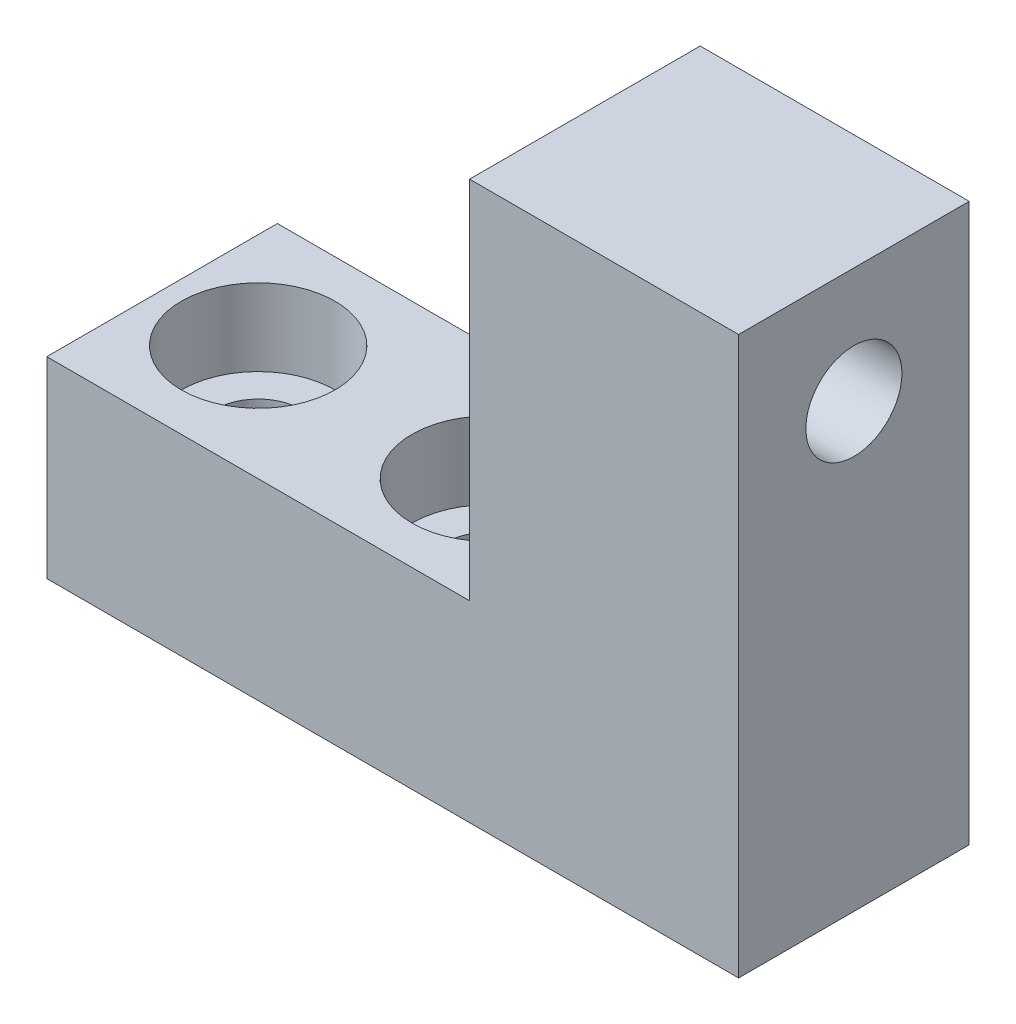
ISO-10303-21;
HEADER;
FILE_DESCRIPTION(('STEP AP214'),'2;1');
FILE_NAME('part.step','',(''),(''),'','','');
FILE_SCHEMA(('AUTOMOTIVE_DESIGN { 1 0 10303 214 1 1 1 1 }'));
ENDSEC;
DATA;
#1=APPLICATION_CONTEXT('core data for automotive mechanical design processes');
#2=APPLICATION_PROTOCOL_DEFINITION('international standard','automotive_design',2000,#1);
#3=PRODUCT_CONTEXT('',#1,'mechanical');
#4=PRODUCT('Part','Part','',(#3));
#5=PRODUCT_RELATED_PRODUCT_CATEGORY('part','',(#4));
#6=PRODUCT_DEFINITION_FORMATION('','',#4);
#7=PRODUCT_DEFINITION_CONTEXT('part definition',#1,'design');
#8=PRODUCT_DEFINITION('design','',#6,#7);
#9=PRODUCT_DEFINITION_SHAPE('','',#8);
#10=(LENGTH_UNIT() NAMED_UNIT(*) SI_UNIT(.MILLI.,.METRE.));
#11=(NAMED_UNIT(*) PLANE_ANGLE_UNIT() SI_UNIT($,.RADIAN.));
#12=(NAMED_UNIT(*) SI_UNIT($,.STERADIAN.) SOLID_ANGLE_UNIT());
#13=UNCERTAINTY_MEASURE_WITH_UNIT(LENGTH_MEASURE(1.E-05),#10,'distance_accuracy_value','');
#14=(GEOMETRIC_REPRESENTATION_CONTEXT(3) GLOBAL_UNCERTAINTY_ASSIGNED_CONTEXT((#13)) GLOBAL_UNIT_ASSIGNED_CONTEXT((#10,
#11,#12)) REPRESENTATION_CONTEXT('',''));
#15=CARTESIAN_POINT('',(0.,0.,0.));
#16=DIRECTION('',(0.,0.,1.));
#17=DIRECTION('',(1.,0.,0.));
#18=AXIS2_PLACEMENT_3D('',#15,#16,#17);
#19=CARTESIAN_POINT('',(8.72260504321214,-6.95626822157435,6.));
#20=DIRECTION('',(0.,1.,0.));
#21=DIRECTION('',(0.,0.,1.));
#22=AXIS2_PLACEMENT_3D('',#19,#20,#21);
#23=CYLINDRICAL_SURFACE('',#22,2.25);
#24=CARTESIAN_POINT('',(8.72260504321214,-6.95626822157435,6.));
#25=DIRECTION('',(0.,1.,0.));
#26=DIRECTION('',(0.,0.,1.));
#27=AXIS2_PLACEMENT_3D('',#24,#25,#26);
#28=CIRCLE('',#27,2.25);
#29=CARTESIAN_POINT('',(8.72260504321214,-6.95626822157435,8.25));
#30=VERTEX_POINT('',#29);
#31=EDGE_CURVE('E146',#30,#30,#28,.T.);
#32=ORIENTED_EDGE('',*,*,#31,.F.);
#33=EDGE_LOOP('',(#32));
#34=FACE_BOUND('',#33,.T.);
#35=CARTESIAN_POINT('',(8.72260504321214,-0.956268221574349,6.));
#36=DIRECTION('',(0.,1.,0.));
#37=DIRECTION('',(0.,0.,1.));
#38=AXIS2_PLACEMENT_3D('',#35,#36,#37);
#39=CIRCLE('',#38,2.25);
#40=CARTESIAN_POINT('',(8.72260504321214,-0.956268221574349,8.25));
#41=VERTEX_POINT('',#40);
#42=EDGE_CURVE('E39',#41,#41,#39,.F.);
#43=ORIENTED_EDGE('',*,*,#42,.F.);
#44=EDGE_LOOP('',(#43));
#45=FACE_BOUND('',#44,.T.);
#46=ADVANCED_FACE('F35',(#34,#45),#23,.F.);
#47=CARTESIAN_POINT('',(-3.27739495678786,-6.95626822157435,6.));
#48=DIRECTION('',(0.,1.,0.));
#49=DIRECTION('',(0.,0.,1.));
#50=AXIS2_PLACEMENT_3D('',#47,#48,#49);
#51=CYLINDRICAL_SURFACE('',#50,2.25);
#52=CARTESIAN_POINT('',(-3.27739495678786,-6.95626822157435,6.));
#53=DIRECTION('',(0.,1.,0.));
#54=DIRECTION('',(0.,0.,1.));
#55=AXIS2_PLACEMENT_3D('',#52,#53,#54);
#56=CIRCLE('',#55,2.25);
#57=CARTESIAN_POINT('',(-3.27739495678786,-6.95626822157435,8.25));
#58=VERTEX_POINT('',#57);
#59=EDGE_CURVE('E121',#58,#58,#56,.T.);
#60=ORIENTED_EDGE('',*,*,#59,.F.);
#61=EDGE_LOOP('',(#60));
#62=FACE_BOUND('',#61,.T.);
#63=CARTESIAN_POINT('',(-3.27739495678786,-0.956268221574349,6.));
#64=DIRECTION('',(0.,1.,0.));
#65=DIRECTION('',(0.,0.,1.));
#66=AXIS2_PLACEMENT_3D('',#63,#64,#65);
#67=CIRCLE('',#66,2.25);
#68=CARTESIAN_POINT('',(-3.27739495678786,-0.956268221574349,8.25));
#69=VERTEX_POINT('',#68);
#70=EDGE_CURVE('E144',#69,#69,#67,.F.);
#71=ORIENTED_EDGE('',*,*,#70,.F.);
#72=EDGE_LOOP('',(#71));
#73=FACE_BOUND('',#72,.T.);
#74=ADVANCED_FACE('F187',(#62,#73),#51,.F.);
#75=CARTESIAN_POINT('',(-8.27739495678786,3.04373177842565,12.));
#76=DIRECTION('',(0.,-1.,0.));
#77=DIRECTION('',(0.,0.,-1.));
#78=AXIS2_PLACEMENT_3D('',#75,#76,#77);
#79=PLANE('',#78);
#80=CARTESIAN_POINT('',(8.72260504321214,3.04373177842565,6.));
#81=DIRECTION('',(0.,1.,0.));
#82=DIRECTION('',(0.,0.,1.));
#83=AXIS2_PLACEMENT_3D('',#80,#81,#82);
#84=CIRCLE('',#83,4.);
#85=CARTESIAN_POINT('',(8.72260504321214,3.04373177842565,10.));
#86=VERTEX_POINT('',#85);
#87=EDGE_CURVE('E159',#86,#86,#84,.T.);
#88=ORIENTED_EDGE('',*,*,#87,.F.);
#89=EDGE_LOOP('',(#88));
#90=FACE_BOUND('',#89,.T.);
#91=CARTESIAN_POINT('',(-3.27739495678786,3.04373177842565,6.));
#92=DIRECTION('',(0.,1.,0.));
#93=DIRECTION('',(0.,0.,1.));
#94=AXIS2_PLACEMENT_3D('',#91,#92,#93);
#95=CIRCLE('',#94,4.);
#96=CARTESIAN_POINT('',(-3.27739495678786,3.04373177842565,10.));
#97=VERTEX_POINT('',#96);
#98=EDGE_CURVE('E152',#97,#97,#95,.T.);
#99=ORIENTED_EDGE('',*,*,#98,.F.);
#100=EDGE_LOOP('',(#99));
#101=FACE_BOUND('',#100,.T.);
#102=DIRECTION('',(0.,0.,1.));
#103=VECTOR('',#102,1.);
#104=CARTESIAN_POINT('',(13.7226050432121,3.04373177842565,12.));
#105=LINE('',#104,#103);
#106=CARTESIAN_POINT('',(13.7226050432121,3.04373177842565,0.));
#107=VERTEX_POINT('',#106);
#108=CARTESIAN_POINT('',(13.7226050432121,3.04373177842565,12.));
#109=VERTEX_POINT('',#108);
#110=EDGE_CURVE('E52',#107,#109,#105,.T.);
#111=ORIENTED_EDGE('',*,*,#110,.F.);
#112=DIRECTION('',(-1.,0.,0.));
#113=VECTOR('',#112,1.);
#114=CARTESIAN_POINT('',(-8.27739495678786,3.04373177842565,0.));
#115=LINE('',#114,#113);
#116=CARTESIAN_POINT('',(-8.27739495678786,3.04373177842565,0.));
#117=VERTEX_POINT('',#116);
#118=EDGE_CURVE('E74',#107,#117,#115,.T.);
#119=ORIENTED_EDGE('',*,*,#118,.T.);
#120=DIRECTION('',(0.,0.,-1.));
#121=VECTOR('',#120,1.);
#122=CARTESIAN_POINT('',(-8.27739495678786,3.04373177842565,12.));
#123=LINE('',#122,#121);
#124=CARTESIAN_POINT('',(-8.27739495678786,3.04373177842565,12.));
#125=VERTEX_POINT('',#124);
#126=EDGE_CURVE('E138',#125,#117,#123,.T.);
#127=ORIENTED_EDGE('',*,*,#126,.F.);
#128=DIRECTION('',(-1.,0.,0.));
#129=VECTOR('',#128,1.);
#130=CARTESIAN_POINT('',(-8.27739495678786,3.04373177842565,12.));
#131=LINE('',#130,#129);
#132=EDGE_CURVE('E60',#109,#125,#131,.T.);
#133=ORIENTED_EDGE('',*,*,#132,.F.);
#134=EDGE_LOOP('',(#111,#119,#127,#133));
#135=FACE_BOUND('',#134,.T.);
#136=ADVANCED_FACE('F193',(#90,#101,#135),#79,.F.);
#137=CARTESIAN_POINT('',(-8.27739495678786,3.04373177842565,12.));
#138=DIRECTION('',(1.,0.,0.));
#139=DIRECTION('',(0.,1.,0.));
#140=AXIS2_PLACEMENT_3D('',#137,#138,#139);
#141=PLANE('',#140);
#142=DIRECTION('',(0.,-1.,0.));
#143=VECTOR('',#142,1.);
#144=CARTESIAN_POINT('',(-8.27739495678786,3.04373177842565,0.));
#145=LINE('',#144,#143);
#146=CARTESIAN_POINT('',(-8.27739495678786,-6.95626822157435,0.));
#147=VERTEX_POINT('',#146);
#148=EDGE_CURVE('E131',#117,#147,#145,.T.);
#149=ORIENTED_EDGE('',*,*,#148,.T.);
#150=DIRECTION('',(0.,0.,-1.));
#151=VECTOR('',#150,1.);
#152=CARTESIAN_POINT('',(-8.27739495678786,-6.95626822157435,12.));
#153=LINE('',#152,#151);
#154=CARTESIAN_POINT('',(-8.27739495678786,-6.95626822157435,12.));
#155=VERTEX_POINT('',#154);
#156=EDGE_CURVE('E11',#155,#147,#153,.T.);
#157=ORIENTED_EDGE('',*,*,#156,.F.);
#158=DIRECTION('',(0.,-1.,0.));
#159=VECTOR('',#158,1.);
#160=CARTESIAN_POINT('',(-8.27739495678786,3.04373177842565,12.));
#161=LINE('',#160,#159);
#162=EDGE_CURVE('E132',#125,#155,#161,.T.);
#163=ORIENTED_EDGE('',*,*,#162,.F.);
#164=ORIENTED_EDGE('',*,*,#126,.T.);
#165=EDGE_LOOP('',(#149,#157,#163,#164));
#166=FACE_BOUND('',#165,.T.);
#167=ADVANCED_FACE('F37',(#166),#141,.F.);
#168=CARTESIAN_POINT('',(-8.27739495678786,-6.95626822157435,12.));
#169=DIRECTION('',(0.,1.,0.));
#170=DIRECTION('',(0.,0.,1.));
#171=AXIS2_PLACEMENT_3D('',#168,#169,#170);
#172=PLANE('',#171);
#173=ORIENTED_EDGE('',*,*,#31,.T.);
#174=EDGE_LOOP('',(#173));
#175=FACE_BOUND('',#174,.T.);
#176=ORIENTED_EDGE('',*,*,#59,.T.);
#177=EDGE_LOOP('',(#176));
#178=FACE_BOUND('',#177,.T.);
#179=DIRECTION('',(1.,0.,0.));
#180=VECTOR('',#179,1.);
#181=CARTESIAN_POINT('',(-8.27739495678786,-6.95626822157435,0.));
#182=LINE('',#181,#180);
#183=CARTESIAN_POINT('',(27.7226050432121,-6.95626822157435,0.));
#184=VERTEX_POINT('',#183);
#185=EDGE_CURVE('E104',#147,#184,#182,.T.);
#186=ORIENTED_EDGE('',*,*,#185,.T.);
#187=DIRECTION('',(0.,0.,-1.));
#188=VECTOR('',#187,1.);
#189=CARTESIAN_POINT('',(27.7226050432121,-6.95626822157435,12.));
#190=LINE('',#189,#188);
#191=CARTESIAN_POINT('',(27.7226050432121,-6.95626822157435,12.));
#192=VERTEX_POINT('',#191);
#193=EDGE_CURVE('E44',#192,#184,#190,.T.);
#194=ORIENTED_EDGE('',*,*,#193,.F.);
#195=DIRECTION('',(1.,0.,0.));
#196=VECTOR('',#195,1.);
#197=CARTESIAN_POINT('',(-8.27739495678786,-6.95626822157435,12.));
#198=LINE('',#197,#196);
#199=EDGE_CURVE('E79',#155,#192,#198,.T.);
#200=ORIENTED_EDGE('',*,*,#199,.F.);
#201=ORIENTED_EDGE('',*,*,#156,.T.);
#202=EDGE_LOOP('',(#186,#194,#200,#201));
#203=FACE_BOUND('',#202,.T.);
#204=ADVANCED_FACE('F177',(#175,#178,#203),#172,.F.);
#205=CARTESIAN_POINT('',(27.7226050432121,3.04373177842565,12.));
#206=DIRECTION('',(-1.,0.,0.));
#207=DIRECTION('',(0.,-1.,0.));
#208=AXIS2_PLACEMENT_3D('',#205,#206,#207);
#209=PLANE('',#208);
#210=CARTESIAN_POINT('',(27.7226050432121,16.0437317784257,6.));
#211=DIRECTION('',(1.,0.,0.));
#212=DIRECTION('',(0.,0.,-1.));
#213=AXIS2_PLACEMENT_3D('',#210,#211,#212);
#214=CIRCLE('',#213,2.49999999999999);
#215=CARTESIAN_POINT('',(27.7226050432121,16.0437317784257,3.50000000000001));
#216=VERTEX_POINT('',#215);
#217=EDGE_CURVE('E168',#216,#216,#214,.T.);
#218=ORIENTED_EDGE('',*,*,#217,.F.);
#219=EDGE_LOOP('',(#218));
#220=FACE_BOUND('',#219,.T.);
#221=DIRECTION('',(0.,1.,0.));
#222=VECTOR('',#221,1.);
#223=CARTESIAN_POINT('',(27.7226050432121,3.04373177842565,0.));
#224=LINE('',#223,#222);
#225=CARTESIAN_POINT('',(27.7226050432121,22.0437317784257,0.));
#226=VERTEX_POINT('',#225);
#227=EDGE_CURVE('E97',#184,#226,#224,.T.);
#228=ORIENTED_EDGE('',*,*,#227,.T.);
#229=DIRECTION('',(0.,0.,-1.));
#230=VECTOR('',#229,1.);
#231=CARTESIAN_POINT('',(27.7226050432121,22.0437317784257,12.));
#232=LINE('',#231,#230);
#233=CARTESIAN_POINT('',(27.7226050432121,22.0437317784257,12.));
#234=VERTEX_POINT('',#233);
#235=EDGE_CURVE('E102',#234,#226,#232,.T.);
#236=ORIENTED_EDGE('',*,*,#235,.F.);
#237=DIRECTION('',(0.,1.,0.));
#238=VECTOR('',#237,1.);
#239=CARTESIAN_POINT('',(27.7226050432121,3.04373177842565,12.));
#240=LINE('',#239,#238);
#241=EDGE_CURVE('E135',#192,#234,#240,.T.);
#242=ORIENTED_EDGE('',*,*,#241,.F.);
#243=ORIENTED_EDGE('',*,*,#193,.T.);
#244=EDGE_LOOP('',(#228,#236,#242,#243));
#245=FACE_BOUND('',#244,.T.);
#246=ADVANCED_FACE('F99',(#220,#245),#209,.F.);
#247=CARTESIAN_POINT('',(0.,0.,12.));
#248=DIRECTION('',(0.,0.,1.));
#249=DIRECTION('',(1.,0.,0.));
#250=AXIS2_PLACEMENT_3D('',#247,#248,#249);
#251=PLANE('',#250);
#252=ORIENTED_EDGE('',*,*,#162,.T.);
#253=ORIENTED_EDGE('',*,*,#199,.T.);
#254=ORIENTED_EDGE('',*,*,#241,.T.);
#255=DIRECTION('',(1.,0.,0.));
#256=VECTOR('',#255,1.);
#257=CARTESIAN_POINT('',(27.7226050432121,22.0437317784257,12.));
#258=LINE('',#257,#256);
#259=CARTESIAN_POINT('',(13.7226050432121,22.0437317784257,12.));
#260=VERTEX_POINT('',#259);
#261=EDGE_CURVE('E119',#260,#234,#258,.T.);
#262=ORIENTED_EDGE('',*,*,#261,.F.);
#263=DIRECTION('',(0.,-1.,0.));
#264=VECTOR('',#263,1.);
#265=CARTESIAN_POINT('',(13.7226050432121,22.0437317784257,12.));
#266=LINE('',#265,#264);
#267=EDGE_CURVE('E127',#260,#109,#266,.T.);
#268=ORIENTED_EDGE('',*,*,#267,.T.);
#269=ORIENTED_EDGE('',*,*,#132,.T.);
#270=EDGE_LOOP('',(#252,#253,#254,#262,#268,#269));
#271=FACE_BOUND('',#270,.T.);
#272=ADVANCED_FACE('F176',(#271),#251,.T.);
#273=CARTESIAN_POINT('',(0.,0.,0.));
#274=DIRECTION('',(0.,0.,1.));
#275=DIRECTION('',(1.,0.,0.));
#276=AXIS2_PLACEMENT_3D('',#273,#274,#275);
#277=PLANE('',#276);
#278=ORIENTED_EDGE('',*,*,#148,.F.);
#279=ORIENTED_EDGE('',*,*,#118,.F.);
#280=DIRECTION('',(0.,-1.,0.));
#281=VECTOR('',#280,1.);
#282=CARTESIAN_POINT('',(13.7226050432121,22.0437317784257,0.));
#283=LINE('',#282,#281);
#284=CARTESIAN_POINT('',(13.7226050432121,22.0437317784257,0.));
#285=VERTEX_POINT('',#284);
#286=EDGE_CURVE('E111',#285,#107,#283,.T.);
#287=ORIENTED_EDGE('',*,*,#286,.F.);
#288=DIRECTION('',(-1.,0.,0.));
#289=VECTOR('',#288,1.);
#290=CARTESIAN_POINT('',(27.7226050432121,22.0437317784257,0.));
#291=LINE('',#290,#289);
#292=EDGE_CURVE('E107',#226,#285,#291,.T.);
#293=ORIENTED_EDGE('',*,*,#292,.F.);
#294=ORIENTED_EDGE('',*,*,#227,.F.);
#295=ORIENTED_EDGE('',*,*,#185,.F.);
#296=EDGE_LOOP('',(#278,#279,#287,#293,#294,#295));
#297=FACE_BOUND('',#296,.T.);
#298=ADVANCED_FACE('F109',(#297),#277,.F.);
#299=CARTESIAN_POINT('',(13.7226050432121,22.0437317784257,12.));
#300=DIRECTION('',(1.,0.,0.));
#301=DIRECTION('',(0.,0.,-1.));
#302=AXIS2_PLACEMENT_3D('',#299,#300,#301);
#303=PLANE('',#302);
#304=CARTESIAN_POINT('',(13.7226050432121,16.0437317784257,6.));
#305=DIRECTION('',(1.,0.,0.));
#306=DIRECTION('',(0.,0.,-1.));
#307=AXIS2_PLACEMENT_3D('',#304,#305,#306);
#308=CIRCLE('',#307,2.49999999999999);
#309=CARTESIAN_POINT('',(13.7226050432121,16.0437317784257,3.50000000000001));
#310=VERTEX_POINT('',#309);
#311=EDGE_CURVE('E163',#310,#310,#308,.T.);
#312=ORIENTED_EDGE('',*,*,#311,.T.);
#313=EDGE_LOOP('',(#312));
#314=FACE_BOUND('',#313,.T.);
#315=ORIENTED_EDGE('',*,*,#110,.T.);
#316=ORIENTED_EDGE('',*,*,#267,.F.);
#317=DIRECTION('',(0.,0.,1.));
#318=VECTOR('',#317,1.);
#319=CARTESIAN_POINT('',(13.7226050432121,22.0437317784257,12.));
#320=LINE('',#319,#318);
#321=EDGE_CURVE('E114',#285,#260,#320,.T.);
#322=ORIENTED_EDGE('',*,*,#321,.F.);
#323=ORIENTED_EDGE('',*,*,#286,.T.);
#324=EDGE_LOOP('',(#315,#316,#322,#323));
#325=FACE_BOUND('',#324,.T.);
#326=ADVANCED_FACE('F205',(#314,#325),#303,.F.);
#327=CARTESIAN_POINT('',(0.,22.0437317784257,0.));
#328=DIRECTION('',(0.,1.,0.));
#329=DIRECTION('',(0.,0.,1.));
#330=AXIS2_PLACEMENT_3D('',#327,#328,#329);
#331=PLANE('',#330);
#332=ORIENTED_EDGE('',*,*,#235,.T.);
#333=ORIENTED_EDGE('',*,*,#292,.T.);
#334=ORIENTED_EDGE('',*,*,#321,.T.);
#335=ORIENTED_EDGE('',*,*,#261,.T.);
#336=EDGE_LOOP('',(#332,#333,#334,#335));
#337=FACE_BOUND('',#336,.T.);
#338=ADVANCED_FACE('F117',(#337),#331,.T.);
#339=CARTESIAN_POINT('',(-3.27739495678786,-0.956268221574348,6.));
#340=DIRECTION('',(0.,1.,0.));
#341=DIRECTION('',(0.,0.,1.));
#342=AXIS2_PLACEMENT_3D('',#339,#340,#341);
#343=PLANE('',#342);
#344=CARTESIAN_POINT('',(-3.27739495678786,-0.956268221574348,6.));
#345=DIRECTION('',(0.,1.,0.));
#346=DIRECTION('',(0.,0.,1.));
#347=AXIS2_PLACEMENT_3D('',#344,#345,#346);
#348=CIRCLE('',#347,4.);
#349=CARTESIAN_POINT('',(-3.27739495678786,-0.956268221574348,10.));
#350=VERTEX_POINT('',#349);
#351=EDGE_CURVE('E147',#350,#350,#348,.T.);
#352=ORIENTED_EDGE('',*,*,#351,.T.);
#353=EDGE_LOOP('',(#352));
#354=FACE_BOUND('',#353,.T.);
#355=ORIENTED_EDGE('',*,*,#70,.T.);
#356=EDGE_LOOP('',(#355));
#357=FACE_BOUND('',#356,.T.);
#358=ADVANCED_FACE('F204',(#354,#357),#343,.T.);
#359=CARTESIAN_POINT('',(-3.27739495678786,-0.956268221574348,6.));
#360=DIRECTION('',(0.,1.,0.));
#361=DIRECTION('',(0.,0.,1.));
#362=AXIS2_PLACEMENT_3D('',#359,#360,#361);
#363=CYLINDRICAL_SURFACE('',#362,4.);
#364=ORIENTED_EDGE('',*,*,#351,.F.);
#365=EDGE_LOOP('',(#364));
#366=FACE_BOUND('',#365,.T.);
#367=ORIENTED_EDGE('',*,*,#98,.T.);
#368=EDGE_LOOP('',(#367));
#369=FACE_BOUND('',#368,.T.);
#370=ADVANCED_FACE('F199',(#366,#369),#363,.F.);
#371=CARTESIAN_POINT('',(8.72260504321214,-0.956268221574348,6.));
#372=DIRECTION('',(0.,1.,0.));
#373=DIRECTION('',(0.,0.,1.));
#374=AXIS2_PLACEMENT_3D('',#371,#372,#373);
#375=PLANE('',#374);
#376=CARTESIAN_POINT('',(8.72260504321214,-0.956268221574348,6.));
#377=DIRECTION('',(0.,1.,0.));
#378=DIRECTION('',(0.,0.,1.));
#379=AXIS2_PLACEMENT_3D('',#376,#377,#378);
#380=CIRCLE('',#379,4.);
#381=CARTESIAN_POINT('',(8.72260504321214,-0.956268221574348,10.));
#382=VERTEX_POINT('',#381);
#383=EDGE_CURVE('E162',#382,#382,#380,.T.);
#384=ORIENTED_EDGE('',*,*,#383,.T.);
#385=EDGE_LOOP('',(#384));
#386=FACE_BOUND('',#385,.T.);
#387=ORIENTED_EDGE('',*,*,#42,.T.);
#388=EDGE_LOOP('',(#387));
#389=FACE_BOUND('',#388,.T.);
#390=ADVANCED_FACE('F221',(#386,#389),#375,.T.);
#391=CARTESIAN_POINT('',(8.72260504321214,-0.956268221574348,6.));
#392=DIRECTION('',(0.,1.,0.));
#393=DIRECTION('',(0.,0.,1.));
#394=AXIS2_PLACEMENT_3D('',#391,#392,#393);
#395=CYLINDRICAL_SURFACE('',#394,4.);
#396=ORIENTED_EDGE('',*,*,#383,.F.);
#397=EDGE_LOOP('',(#396));
#398=FACE_BOUND('',#397,.T.);
#399=ORIENTED_EDGE('',*,*,#87,.T.);
#400=EDGE_LOOP('',(#399));
#401=FACE_BOUND('',#400,.T.);
#402=ADVANCED_FACE('F227',(#398,#401),#395,.F.);
#403=CARTESIAN_POINT('',(27.7226050432121,16.0437317784257,6.));
#404=DIRECTION('',(1.,0.,0.));
#405=DIRECTION('',(0.,0.,-1.));
#406=AXIS2_PLACEMENT_3D('',#403,#404,#405);
#407=CYLINDRICAL_SURFACE('',#406,2.49999999999999);
#408=ORIENTED_EDGE('',*,*,#217,.T.);
#409=EDGE_LOOP('',(#408));
#410=FACE_BOUND('',#409,.T.);
#411=ORIENTED_EDGE('',*,*,#311,.F.);
#412=EDGE_LOOP('',(#411));
#413=FACE_BOUND('',#412,.T.);
#414=ADVANCED_FACE('F172',(#410,#413),#407,.F.);
#415=CLOSED_SHELL('',(#46,#74,#136,#167,#204,#246,#272,#298,#326,#338,#358,#370,#390,#402,#414));
#416=MANIFOLD_SOLID_BREP('B2',#415);
#417=ADVANCED_BREP_SHAPE_REPRESENTATION('',(#18,#416),#14);
#418=SHAPE_DEFINITION_REPRESENTATION(#9,#417);
ENDSEC;
END-ISO-10303-21;
